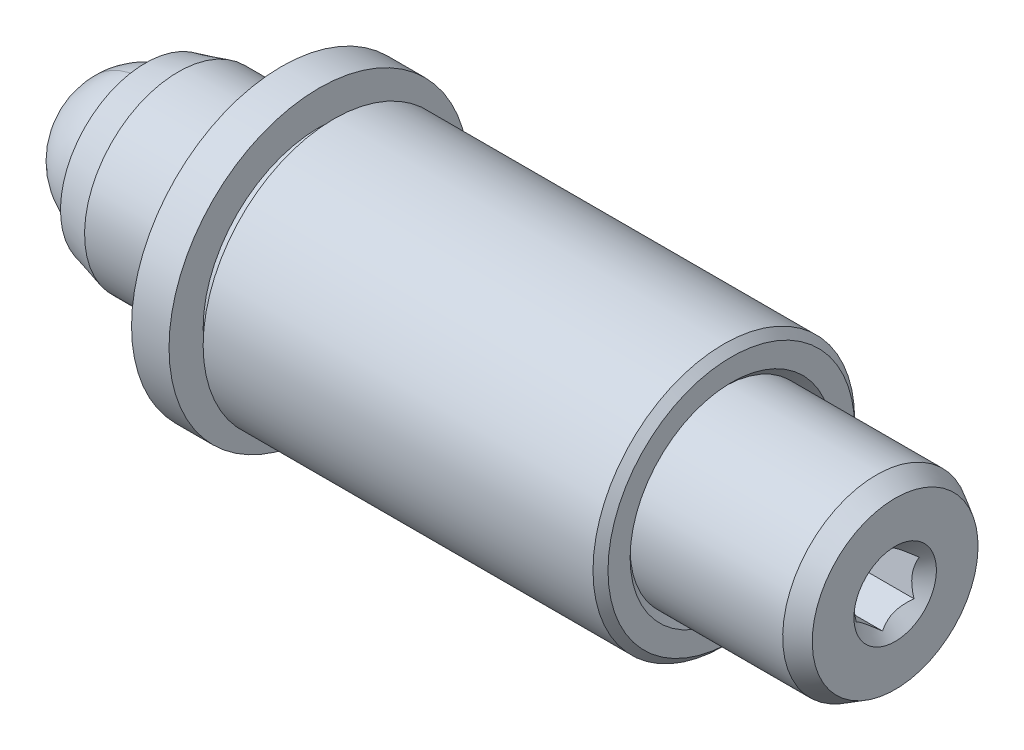
ISO-10303-21;
HEADER;
FILE_DESCRIPTION(('STEP AP214'),'2;1');
FILE_NAME('part.step','',(''),(''),'','','');
FILE_SCHEMA(('AUTOMOTIVE_DESIGN { 1 0 10303 214 1 1 1 1 }'));
ENDSEC;
DATA;
#1=APPLICATION_CONTEXT('core data for automotive mechanical design processes');
#2=APPLICATION_PROTOCOL_DEFINITION('international standard','automotive_design',2000,#1);
#3=PRODUCT_CONTEXT('',#1,'mechanical');
#4=PRODUCT('Part','Part','',(#3));
#5=PRODUCT_RELATED_PRODUCT_CATEGORY('part','',(#4));
#6=PRODUCT_DEFINITION_FORMATION('','',#4);
#7=PRODUCT_DEFINITION_CONTEXT('part definition',#1,'design');
#8=PRODUCT_DEFINITION('design','',#6,#7);
#9=PRODUCT_DEFINITION_SHAPE('','',#8);
#10=(LENGTH_UNIT() NAMED_UNIT(*) SI_UNIT(.MILLI.,.METRE.));
#11=(NAMED_UNIT(*) PLANE_ANGLE_UNIT() SI_UNIT($,.RADIAN.));
#12=(NAMED_UNIT(*) SI_UNIT($,.STERADIAN.) SOLID_ANGLE_UNIT());
#13=UNCERTAINTY_MEASURE_WITH_UNIT(LENGTH_MEASURE(1.E-05),#10,'distance_accuracy_value','');
#14=(GEOMETRIC_REPRESENTATION_CONTEXT(3) GLOBAL_UNCERTAINTY_ASSIGNED_CONTEXT((#13)) GLOBAL_UNIT_ASSIGNED_CONTEXT((#10,
#11,#12)) REPRESENTATION_CONTEXT('',''));
#15=CARTESIAN_POINT('',(0.,0.,0.));
#16=DIRECTION('',(0.,0.,1.));
#17=DIRECTION('',(1.,0.,0.));
#18=AXIS2_PLACEMENT_3D('',#15,#16,#17);
#19=CARTESIAN_POINT('',(25.3187790340393,3.84761011098279,-7.38312383629523));
#20=DIRECTION('',(1.,0.,0.));
#21=DIRECTION('',(0.,-0.151537101196792,-0.988451570366942));
#22=AXIS2_PLACEMENT_3D('',#19,#20,#21);
#23=PLANE('',#22);
#24=CARTESIAN_POINT('',(25.3187790340393,0.709276375067749,-6.90199353999541));
#25=DIRECTION('',(1.,0.,0.));
#26=DIRECTION('',(0.,-0.151537101196792,-0.988451570366942));
#27=AXIS2_PLACEMENT_3D('',#24,#25,#26);
#28=CIRCLE('',#27,2.80838257906458);
#29=CARTESIAN_POINT('',(25.3187790340393,0.283702219984732,-9.67794371046296));
#30=VERTEX_POINT('',#29);
#31=EDGE_CURVE('P0_E29',#30,#30,#28,.T.);
#32=ORIENTED_EDGE('',*,*,#31,.T.);
#33=EDGE_LOOP('',(#32));
#34=FACE_BOUND('',#33,.T.);
#35=CARTESIAN_POINT('',(25.3187790340393,0.709276375067749,-6.90199353999541));
#36=DIRECTION('',(-1.,0.,0.));
#37=DIRECTION('',(0.,0.151537101196792,0.988451570366942));
#38=AXIS2_PLACEMENT_3D('',#35,#36,#37);
#39=CIRCLE('',#38,1.397);
#40=CARTESIAN_POINT('',(25.3187790340393,0.920973705439667,-5.52112669619279));
#41=VERTEX_POINT('',#40);
#42=EDGE_CURVE('P0_E185',#41,#41,#39,.T.);
#43=ORIENTED_EDGE('',*,*,#42,.T.);
#44=EDGE_LOOP('',(#43));
#45=FACE_BOUND('',#44,.T.);
#46=ADVANCED_FACE('P0_F16',(#34,#45),#23,.T.);
#47=CARTESIAN_POINT('',(-0.0812209659606915,0.709276375067749,-6.90199353999541));
#48=DIRECTION('',(-1.,0.,0.));
#49=DIRECTION('',(0.,0.151537101196792,0.988451570366942));
#50=AXIS2_PLACEMENT_3D('',#47,#48,#49);
#51=CYLINDRICAL_SURFACE('',#50,3.175);
#52=CARTESIAN_POINT('',(24.6837790340393,0.709276375067749,-6.90199353999541));
#53=DIRECTION('',(1.,0.,0.));
#54=DIRECTION('',(0.,-0.151537101196792,-0.988451570366942));
#55=AXIS2_PLACEMENT_3D('',#52,#53,#54);
#56=CIRCLE('',#55,3.175);
#57=CARTESIAN_POINT('',(24.6837790340393,0.228146078767935,-10.0403272759104));
#58=VERTEX_POINT('',#57);
#59=EDGE_CURVE('P0_E211',#58,#58,#56,.F.);
#60=ORIENTED_EDGE('',*,*,#59,.T.);
#61=EDGE_LOOP('',(#60));
#62=FACE_BOUND('',#61,.T.);
#63=CARTESIAN_POINT('',(1.03230858147812,0.709276375067749,-6.90199353999541));
#64=DIRECTION('',(-1.,0.,0.));
#65=DIRECTION('',(0.,0.151537101196792,0.988451570366942));
#66=AXIS2_PLACEMENT_3D('',#63,#64,#65);
#67=CIRCLE('',#66,3.175);
#68=CARTESIAN_POINT('',(1.03230858147812,1.19040667136756,-3.76365980408037));
#69=VERTEX_POINT('',#68);
#70=EDGE_CURVE('P0_E208',#69,#69,#67,.T.);
#71=ORIENTED_EDGE('',*,*,#70,.F.);
#72=EDGE_LOOP('',(#71));
#73=FACE_BOUND('',#72,.T.);
#74=ADVANCED_FACE('P0_F89',(#62,#73),#51,.T.);
#75=CARTESIAN_POINT('',(-0.0812209659606915,0.709276375067749,-6.90199353999541));
#76=DIRECTION('',(1.,0.,0.));
#77=DIRECTION('',(0.,-0.151537101196792,-0.988451570366942));
#78=AXIS2_PLACEMENT_3D('',#75,#76,#77);
#79=CONICAL_SURFACE('',#78,2.87663065701558,0.261799387799143);
#80=ORIENTED_EDGE('',*,*,#70,.T.);
#81=EDGE_LOOP('',(#80));
#82=FACE_BOUND('',#81,.T.);
#83=CARTESIAN_POINT('',(-0.0812209659606915,0.709276375067749,-6.90199353999541));
#84=DIRECTION('',(-1.,0.,0.));
#85=DIRECTION('',(0.,0.151537101196792,0.988451570366942));
#86=AXIS2_PLACEMENT_3D('',#83,#84,#85);
#87=CIRCLE('',#86,2.87663065701558);
#88=CARTESIAN_POINT('',(-0.0812209659606915,1.14519264604571,-4.05858344970267));
#89=VERTEX_POINT('',#88);
#90=EDGE_CURVE('P0_E204',#89,#89,#87,.T.);
#91=ORIENTED_EDGE('',*,*,#90,.F.);
#92=EDGE_LOOP('',(#91));
#93=FACE_BOUND('',#92,.T.);
#94=ADVANCED_FACE('P0_F95',(#82,#93),#79,.T.);
#95=CARTESIAN_POINT('',(-0.0812209659606916,3.55268646536049,-7.33790981097337));
#96=DIRECTION('',(-1.,0.,0.));
#97=DIRECTION('',(0.,0.151537101196792,0.988451570366942));
#98=AXIS2_PLACEMENT_3D('',#95,#96,#97);
#99=PLANE('',#98);
#100=ORIENTED_EDGE('',*,*,#90,.T.);
#101=EDGE_LOOP('',(#100));
#102=FACE_BOUND('',#101,.T.);
#103=CARTESIAN_POINT('',(-0.0812209659606915,0.709276375067749,-6.90199353999541));
#104=DIRECTION('',(-1.,0.,0.));
#105=DIRECTION('',(0.,0.151537101196792,0.988451570366942));
#106=AXIS2_PLACEMENT_3D('',#103,#104,#105);
#107=CIRCLE('',#106,2.74963065701558);
#108=CARTESIAN_POINT('',(-0.0812209659606915,1.12594743419372,-4.18411679913927));
#109=VERTEX_POINT('',#108);
#110=EDGE_CURVE('P0_E201',#109,#109,#107,.T.);
#111=ORIENTED_EDGE('',*,*,#110,.F.);
#112=EDGE_LOOP('',(#111));
#113=FACE_BOUND('',#112,.T.);
#114=ADVANCED_FACE('P0_F103',(#102,#113),#99,.T.);
#115=CARTESIAN_POINT('',(1.1094040340393,0.709276375067749,-6.90199353999541));
#116=DIRECTION('',(-1.,0.,0.));
#117=DIRECTION('',(0.,0.151537101196792,0.988451570366942));
#118=AXIS2_PLACEMENT_3D('',#115,#116,#117);
#119=CONICAL_SURFACE('',#118,2.0622229927617,0.523598775598294);
#120=ORIENTED_EDGE('',*,*,#110,.T.);
#121=EDGE_LOOP('',(#120));
#122=FACE_BOUND('',#121,.T.);
#123=CARTESIAN_POINT('',(4.68127903403936,0.709276375067749,-6.90199353999541));
#124=VERTEX_POINT('',#123);
#125=VERTEX_LOOP('',#124);
#126=FACE_BOUND('',#125,.T.);
#127=ADVANCED_FACE('P0_F107',(#122,#126),#119,.F.);
#128=CARTESIAN_POINT('',(24.6837790340393,0.709276375067749,-6.90199353999541));
#129=DIRECTION('',(-1.,0.,0.));
#130=DIRECTION('',(0.,0.151537101196792,0.988451570366942));
#131=AXIS2_PLACEMENT_3D('',#128,#129,#130);
#132=CONICAL_SURFACE('',#131,3.175,0.5235987755983);
#133=ORIENTED_EDGE('',*,*,#31,.F.);
#134=EDGE_LOOP('',(#133));
#135=FACE_BOUND('',#134,.T.);
#136=ORIENTED_EDGE('',*,*,#59,.F.);
#137=EDGE_LOOP('',(#136));
#138=FACE_BOUND('',#137,.T.);
#139=ADVANCED_FACE('P0_F18',(#135,#138),#132,.T.);
#140=CARTESIAN_POINT('',(25.3187790340393,0.709276375067749,-6.90199353999541));
#141=DIRECTION('',(1.,0.,0.));
#142=DIRECTION('',(0.,-0.151537101196792,-0.988451570366942));
#143=AXIS2_PLACEMENT_3D('',#140,#141,#142);
#144=CONICAL_SURFACE('',#143,1.397,0.785398163397454);
#145=ORIENTED_EDGE('',*,*,#42,.F.);
#146=EDGE_LOOP('',(#145));
#147=FACE_BOUND('',#146,.T.);
#148=CARTESIAN_POINT('',(25.0657408748947,1.84005754324019,-7.07514850827498));
#149=CARTESIAN_POINT('',(25.0460896704963,1.81545908651196,-7.10583482017609));
#150=CARTESIAN_POINT('',(25.0275921667767,1.79044930617444,-7.13703425388424));
#151=CARTESIAN_POINT('',(24.9937230506719,1.7394512863709,-7.2006537386072));
#152=CARTESIAN_POINT('',(24.9783702936805,1.7134581919804,-7.23307984608842));
#153=CARTESIAN_POINT('',(24.9520705638843,1.6610441958544,-7.29846574614206));
#154=CARTESIAN_POINT('',(24.9410574527661,1.63463665722172,-7.3314088683865));
#155=CARTESIAN_POINT('',(24.9240884332977,1.58124035587483,-7.39802018370596));
#156=CARTESIAN_POINT('',(24.9181198517434,1.55425322539957,-7.43168634058031));
#157=CARTESIAN_POINT('',(24.9127367487892,1.50774430142119,-7.48970572623337));
#158=CARTESIAN_POINT('',(24.9119406739463,1.48828301913849,-7.51398346791125));
#159=CARTESIAN_POINT('',(24.9132777242888,1.44939814073531,-7.56249193818236));
#160=CARTESIAN_POINT('',(24.915411495714,1.42997455387578,-7.58672265522266));
#161=CARTESIAN_POINT('',(24.9260666004169,1.37198116150141,-7.65906879247284));
#162=CARTESIAN_POINT('',(24.9388429323801,1.33369996508028,-7.70682417592249));
#163=CARTESIAN_POINT('',(24.9696766239764,1.26651217396672,-7.79064022734537));
#164=CARTESIAN_POINT('',(24.9861178455829,1.23729051465984,-7.82709393505824));
#165=CARTESIAN_POINT('',(25.0231539361576,1.17999176444748,-7.8985735136345));
#166=CARTESIAN_POINT('',(25.0437352904535,1.15191129787264,-7.93360359560932));
#167=CARTESIAN_POINT('',(25.0657408748947,1.124337640744,-7.96800143821595));
#168=B_SPLINE_CURVE_WITH_KNOTS('',3,(#148,#149,#150,#151,#152,#153,#154,#155,#156,#157,#158,
#159,#160,#161,#162,#163,#164,#165,#166,#167),.UNSPECIFIED.,.F.,.F.,(4,2,2,2,2,2,2,2,2,4),(0.,
0.13198575731363,0.264741099720079,0.395386727542093,0.525703154748065,0.618943658290853,
0.712204731307293,0.898780059957001,1.04716773824742,1.19507867219892),.UNSPECIFIED.);
#169=CARTESIAN_POINT('',(25.0656253873578,1.83991309926391,-7.07532870059182));
#170=VERTEX_POINT('',#169);
#171=CARTESIAN_POINT('',(25.0656253873578,1.12448208472029,-7.96782124589911));
#172=VERTEX_POINT('',#171);
#173=EDGE_CURVE('P0_E121',#170,#172,#168,.T.);
#174=ORIENTED_EDGE('',*,*,#173,.T.);
#175=CARTESIAN_POINT('',(27.6246008361541,-2.96748976697398,-7.34049101427792));
#176=CARTESIAN_POINT('',(27.5367450230196,-2.87735515648311,-7.35430933173602));
#177=CARTESIAN_POINT('',(27.4490058909628,-2.78710889925952,-7.36814476548261));
#178=CARTESIAN_POINT('',(27.2738397088148,-2.6063100178771,-7.39586260134395));
#179=CARTESIAN_POINT('',(27.1864126789646,-2.51575737456407,-7.40974500639518));
#180=CARTESIAN_POINT('',(27.0116956545964,-2.33399845022917,-7.43761002410175));
#181=CARTESIAN_POINT('',(26.9244068832256,-2.24279101921719,-7.45159281305926));
#182=CARTESIAN_POINT('',(26.7503690541866,-2.05988270148838,-7.47963404146574));
#183=CARTESIAN_POINT('',(26.6636199698372,-1.96818183959071,-7.49369247710975));
#184=CARTESIAN_POINT('',(26.4803043459046,-1.77288881233363,-7.52363237514997));
#185=CARTESIAN_POINT('',(26.3838312071016,-1.66921074381141,-7.53952700715072));
#186=CARTESIAN_POINT('',(26.1922022242586,-1.46063871995851,-7.57150267579545));
#187=CARTESIAN_POINT('',(26.0970466009912,-1.35574456613512,-7.58758374286987));
#188=CARTESIAN_POINT('',(25.9089422514998,-1.1443461696576,-7.61999271581324));
#189=CARTESIAN_POINT('',(25.8159899807509,-1.03784503836504,-7.63632014468693));
#190=CARTESIAN_POINT('',(25.6791646449912,-0.875964153114442,-7.66113770866827));
#191=CARTESIAN_POINT('',(25.6339961203745,-0.821656662135799,-7.66946345775188));
#192=CARTESIAN_POINT('',(25.5448365389851,-0.712107745595139,-7.68625813515389));
#193=CARTESIAN_POINT('',(25.5008454018662,-0.656866384183415,-7.69472705363757));
#194=CARTESIAN_POINT('',(25.4090763841468,-0.538174670739413,-7.71292339094998));
#195=CARTESIAN_POINT('',(25.3615126407606,-0.47456143330758,-7.72267578134235));
#196=CARTESIAN_POINT('',(25.2693699184927,-0.345087429615771,-7.74252512529403));
#197=CARTESIAN_POINT('',(25.2247952840241,-0.279223593418003,-7.75262254949804));
#198=CARTESIAN_POINT('',(25.1411953660683,-0.145672601825798,-7.77309692652829));
#199=CARTESIAN_POINT('',(25.102087431109,-0.0780366904100693,-7.78346602326506));
#200=CARTESIAN_POINT('',(25.031549772854,0.0610169759798711,-7.80478400195742));
#201=CARTESIAN_POINT('',(25.0000974812802,0.132422841030938,-7.81573106109788));
#202=CARTESIAN_POINT('',(24.964565909691,0.235942934991404,-7.83160147440358));
#203=CARTESIAN_POINT('',(24.9553001973986,0.266313306514104,-7.83625748204299));
#204=CARTESIAN_POINT('',(24.9392392324358,0.327695682909499,-7.84566786456692));
#205=CARTESIAN_POINT('',(24.9324438944314,0.358707665579889,-7.85042223604765));
#206=CARTESIAN_POINT('',(24.9217070774874,0.421040229139728,-7.85997828944996));
#207=CARTESIAN_POINT('',(24.9177499167903,0.452358129796872,-7.86477956047166));
#208=CARTESIAN_POINT('',(24.912868461278,0.515233739013183,-7.87441886688005));
#209=CARTESIAN_POINT('',(24.9119446638363,0.546791486049223,-7.87925690816554));
#210=CARTESIAN_POINT('',(24.9131769761599,0.609063059632471,-7.88880361134318));
#211=CARTESIAN_POINT('',(24.9152571918777,0.639778386965046,-7.89351250331708));
#212=CARTESIAN_POINT('',(24.9222306767221,0.700901479384611,-7.9028831356466));
#213=CARTESIAN_POINT('',(24.9271252544042,0.731309094701894,-7.90754485304139));
#214=CARTESIAN_POINT('',(24.9457083321476,0.822054074911334,-7.92145674479345));
#215=CARTESIAN_POINT('',(24.963286410024,0.881621165361508,-7.93058883025334));
#216=CARTESIAN_POINT('',(25.0090126394503,1.00646806456855,-7.94972880409365));
#217=CARTESIAN_POINT('',(25.0383326901798,1.07130493658119,-7.95966878692135));
#218=CARTESIAN_POINT('',(25.1032299269344,1.19790933932228,-7.97907819934508));
#219=CARTESIAN_POINT('',(25.1388203113528,1.25967003616737,-7.98854658125511));
#220=CARTESIAN_POINT('',(25.2144706570072,1.38151649842112,-8.00722656541879));
#221=CARTESIAN_POINT('',(25.2545825996289,1.44157015235773,-8.01643324474093));
#222=CARTESIAN_POINT('',(25.3374567577588,1.55975000354966,-8.03455110969898));
#223=CARTESIAN_POINT('',(25.3802162250975,1.61787810641759,-8.04346258747972));
#224=CARTESIAN_POINT('',(25.4686852652452,1.73420479128877,-8.06129634802569));
#225=CARTESIAN_POINT('',(25.5144420858569,1.79236802191114,-8.07021321115687));
#226=CARTESIAN_POINT('',(25.607335768457,1.90761091340444,-8.08788081798151));
#227=CARTESIAN_POINT('',(25.6544727639041,1.96469046860167,-8.09663154547439));
#228=CARTESIAN_POINT('',(25.7974048793696,2.13474514674196,-8.12270221372247));
#229=CARTESIAN_POINT('',(25.8946884834053,2.24649458738522,-8.13983424811153));
#230=CARTESIAN_POINT('',(26.0917102888441,2.46821789374279,-8.17382610782472));
#231=CARTESIAN_POINT('',(26.1914528502648,2.57818793223579,-8.19068534640688));
#232=CARTESIAN_POINT('',(26.3923720087802,2.79679528824881,-8.22419950736695));
#233=CARTESIAN_POINT('',(26.4935482921097,2.90543288794888,-8.24085447300519));
#234=CARTESIAN_POINT('',(26.6864803553642,3.11074780750801,-8.27233080292886));
#235=CARTESIAN_POINT('',(26.7781415556776,3.20751223332088,-8.28716552121577));
#236=CARTESIAN_POINT('',(26.9620452353932,3.40051157416295,-8.31675377978189));
#237=CARTESIAN_POINT('',(27.0542877526351,3.49674645394248,-8.33150731465705));
#238=CARTESIAN_POINT('',(27.2388792475286,3.68847593743714,-8.36090089448813));
#239=CARTESIAN_POINT('',(27.3312267260393,3.78397195293414,-8.37554115588089));
#240=CARTESIAN_POINT('',(27.5162486679006,3.97463928273758,-8.40477189951826));
#241=CARTESIAN_POINT('',(27.6089231042404,4.06981062264518,-8.41936238568771));
#242=CARTESIAN_POINT('',(27.7017186616355,4.16486586555687,-8.43393507330967));
#243=B_SPLINE_CURVE_WITH_KNOTS('',3,(#175,#176,#177,#178,#179,#180,#181,#182,#183,#184,#185,
#186,#187,#188,#189,#190,#191,#192,#193,#194,#195,#196,#197,#198,#199,#200,#201,#202,#203,#204,
#205,#206,#207,#208,#209,#210,#211,#212,#213,#214,#215,#216,#217,#218,#219,#220,#221,#222,#223,
#224,#225,#226,#227,#228,#229,#230,#231,#232,#233,#234,#235,#236,#237,#238,#239,#240,#241,#242),
.UNSPECIFIED.,.F.,.F.,(4,2,2,2,2,2,2,2,2,2,2,2,2,2,2,2,2,2,2,2,2,2,2,2,2,2,2,2,2,2,2,2,2,4),(0.,
0.379874835988938,0.759773876203374,1.14082701041048,1.52186115387162,1.94938001736954,
2.37696967257862,2.80381700436518,3.01718157744285,3.23053155296424,3.47055378498738,
3.71091762864544,3.94712387105913,4.18262512424182,4.27881732966127,4.37500621199584,
4.47065944041732,4.56632835209358,4.65962213579648,4.75295933214987,4.94050930933201,
5.15555780798493,5.37106449029749,5.58936617401833,5.80744493764421,6.03103556745281,
6.25464788967338,6.70203244465328,7.15027722868556,7.5984253860746,8.00074953073231,
8.40310014008475,8.80404436426246,9.20495620671305),.UNSPECIFIED.);
#244=CARTESIAN_POINT('',(25.0656253873578,-0.00615463947587164,-7.7944860853027));
#245=VERTEX_POINT('',#244);
#246=EDGE_CURVE('P0_E128',#172,#245,#243,.F.);
#247=ORIENTED_EDGE('',*,*,#246,.T.);
#248=CARTESIAN_POINT('',(25.0657408748947,-0.00607081034006399,-7.794701273614));
#249=CARTESIAN_POINT('',(25.0460896704963,-0.0203467076307624,-7.7580552292429));
#250=CARTESIAN_POINT('',(25.0275921667767,-0.034861319636949,-7.72079640727347));
#251=CARTESIAN_POINT('',(24.9937230506719,-0.0644583996809437,-7.64482108421942));
#252=CARTESIAN_POINT('',(24.9783702936805,-0.0795436853102713,-7.60609735041368));
#253=CARTESIAN_POINT('',(24.9520705638843,-0.109962537743033,-7.52801254822788));
#254=CARTESIAN_POINT('',(24.9410574527661,-0.125288349170359,-7.48867138779834));
#255=CARTESIAN_POINT('',(24.9240884332977,-0.156277289743058,-7.40912317670407));
#256=CARTESIAN_POINT('',(24.9181198517434,-0.171939471606412,-7.36891855770007));
#257=CARTESIAN_POINT('',(24.9127367487892,-0.198931271504737,-7.29963095520559));
#258=CARTESIAN_POINT('',(24.9119406739463,-0.210225771402947,-7.27063811951961));
#259=CARTESIAN_POINT('',(24.9132777242888,-0.232792899754859,-7.21270859186383));
#260=CARTESIAN_POINT('',(24.915411495714,-0.244065522833903,-7.18377191369072));
#261=CARTESIAN_POINT('',(24.9260666004169,-0.277722419371048,-7.09737509401778));
#262=CARTESIAN_POINT('',(24.9388429323801,-0.299939196395348,-7.040344913705));
#263=CARTESIAN_POINT('',(24.9696766239764,-0.338932130615687,-6.94025055406505));
#264=CARTESIAN_POINT('',(24.9861178455829,-0.355891137903729,-6.89671700090813));
#265=CARTESIAN_POINT('',(25.0231539361576,-0.389144893696389,-6.811355038331));
#266=CARTESIAN_POINT('',(25.0437352904535,-0.405441601295819,-6.76952159993965));
#267=CARTESIAN_POINT('',(25.0657408748947,-0.421444178264215,-6.7284431910877));
#268=B_SPLINE_CURVE_WITH_KNOTS('',3,(#248,#249,#250,#251,#252,#253,#254,#255,#256,#257,#258,
#259,#260,#261,#262,#263,#264,#265,#266,#267),.UNSPECIFIED.,.F.,.F.,(4,2,2,2,2,2,2,2,2,4),(0.,
0.13198575731363,0.264741099720076,0.395386727542088,0.525703154748062,0.618943658290851,
0.712204731307289,0.898780059956998,1.04716773824742,1.19507867219892),.UNSPECIFIED.);
#269=CARTESIAN_POINT('',(25.0656253873578,-0.421360349128405,-6.728658379399));
#270=VERTEX_POINT('',#269);
#271=EDGE_CURVE('P0_E157',#245,#270,#268,.T.);
#272=ORIENTED_EDGE('',*,*,#271,.T.);
#273=CARTESIAN_POINT('',(25.0657408748947,-0.42150479310469,-6.72883857171585));
#274=CARTESIAN_POINT('',(25.0460896704963,-0.396906336376455,-6.69815225981473));
#275=CARTESIAN_POINT('',(25.0275921667767,-0.371896556038938,-6.66695282610658));
#276=CARTESIAN_POINT('',(24.9937230506719,-0.320898536235396,-6.60333334138362));
#277=CARTESIAN_POINT('',(24.9783702936805,-0.294905441844903,-6.57090723390241));
#278=CARTESIAN_POINT('',(24.9520705638843,-0.242491445718898,-6.50552133384876));
#279=CARTESIAN_POINT('',(24.9410574527661,-0.216083907086223,-6.47257821160432));
#280=CARTESIAN_POINT('',(24.9240884332977,-0.16268760573933,-6.40596689628486));
#281=CARTESIAN_POINT('',(24.9181198517434,-0.135700475264071,-6.37230073941051));
#282=CARTESIAN_POINT('',(24.9127367487892,-0.0891915512856962,-6.31428135375745));
#283=CARTESIAN_POINT('',(24.9119406739463,-0.0697302690029892,-6.29000361207957));
#284=CARTESIAN_POINT('',(24.9132777242888,-0.0308453905998091,-6.24149514180846));
#285=CARTESIAN_POINT('',(24.915411495714,-0.0114218037402811,-6.21726442476817));
#286=CARTESIAN_POINT('',(24.9260666004169,0.0465715886340904,-6.14491828751799));
#287=CARTESIAN_POINT('',(24.9388429323801,0.0848527850552218,-6.09716290406833));
#288=CARTESIAN_POINT('',(24.9696766239764,0.152040576168778,-6.01334685264545));
#289=CARTESIAN_POINT('',(24.9861178455829,0.181262235475657,-5.97689314493258));
#290=CARTESIAN_POINT('',(25.0231539361576,0.238560985688022,-5.90541356635633));
#291=CARTESIAN_POINT('',(25.0437352904535,0.266641452262862,-5.8703834843815));
#292=CARTESIAN_POINT('',(25.0657408748947,0.294215109391498,-5.83598564177488));
#293=B_SPLINE_CURVE_WITH_KNOTS('',3,(#273,#274,#275,#276,#277,#278,#279,#280,#281,#282,#283,
#284,#285,#286,#287,#288,#289,#290,#291,#292),.UNSPECIFIED.,.F.,.F.,(4,2,2,2,2,2,2,2,2,4),(0.,
0.131985757313632,0.264741099720078,0.395386727542091,0.525703154748064,0.618943658290851,
0.71220473130729,0.898780059957001,1.04716773824742,1.19507867219892),.UNSPECIFIED.);
#294=CARTESIAN_POINT('',(25.0656253873578,0.294070665415212,-5.83616583409172));
#295=VERTEX_POINT('',#294);
#296=EDGE_CURVE('P0_E152',#270,#295,#293,.T.);
#297=ORIENTED_EDGE('',*,*,#296,.T.);
#298=CARTESIAN_POINT('',(27.6246008361541,-2.6672644620829,-5.38217076306693));
#299=CARTESIAN_POINT('',(27.5367450230196,-2.57712985159202,-5.39598908052503));
#300=CARTESIAN_POINT('',(27.4490058909628,-2.48688359436843,-5.40982451427162));
#301=CARTESIAN_POINT('',(27.2738397088149,-2.30608471298601,-5.43754235013296));
#302=CARTESIAN_POINT('',(27.1864126789646,-2.21553206967298,-5.45142475518419));
#303=CARTESIAN_POINT('',(27.0116956545964,-2.03377314533808,-5.47928977289076));
#304=CARTESIAN_POINT('',(26.9244068832256,-1.9425657143261,-5.49327256184827));
#305=CARTESIAN_POINT('',(26.7503690541866,-1.7596573965973,-5.52131379025475));
#306=CARTESIAN_POINT('',(26.6636199698372,-1.66795653469963,-5.53537222589876));
#307=CARTESIAN_POINT('',(26.4803043459046,-1.47266350744255,-5.56531212393898));
#308=CARTESIAN_POINT('',(26.3838312071016,-1.36898543892033,-5.58120675593972));
#309=CARTESIAN_POINT('',(26.1922022242586,-1.16041341506742,-5.61318242458445));
#310=CARTESIAN_POINT('',(26.0970466009912,-1.05551926124403,-5.62926349165887));
#311=CARTESIAN_POINT('',(25.9089422514998,-0.844120864766512,-5.66167246460224));
#312=CARTESIAN_POINT('',(25.8159899807509,-0.73761973347395,-5.67799989347593));
#313=CARTESIAN_POINT('',(25.6791646449912,-0.575738848223351,-5.70281745745728));
#314=CARTESIAN_POINT('',(25.6339961203745,-0.521431357244707,-5.71114320654089));
#315=CARTESIAN_POINT('',(25.5448365389851,-0.41188244070405,-5.7279378839429));
#316=CARTESIAN_POINT('',(25.5008454018662,-0.35664107929233,-5.73640680242658));
#317=CARTESIAN_POINT('',(25.4090763841468,-0.237949365848329,-5.754603139739));
#318=CARTESIAN_POINT('',(25.3615126407606,-0.174336128416492,-5.76435553013135));
#319=CARTESIAN_POINT('',(25.2693699184927,-0.0448621247246804,-5.78420487408304));
#320=CARTESIAN_POINT('',(25.2247952840241,0.0210017114730864,-5.79430229828705));
#321=CARTESIAN_POINT('',(25.1411953660684,0.154552703065293,-5.8147766753173));
#322=CARTESIAN_POINT('',(25.102087431109,0.222188614481025,-5.82514577205406));
#323=CARTESIAN_POINT('',(25.031549772854,0.361242280870962,-5.84646375074643));
#324=CARTESIAN_POINT('',(25.0000974812801,0.432648145922021,-5.85741080988691));
#325=CARTESIAN_POINT('',(24.964565909691,0.536168239882489,-5.87328122319259));
#326=CARTESIAN_POINT('',(24.9553001973986,0.566538611405191,-5.877937230832));
#327=CARTESIAN_POINT('',(24.9392392324358,0.627920987800587,-5.88734761335593));
#328=CARTESIAN_POINT('',(24.9324438944314,0.658932970470977,-5.89210198483666));
#329=CARTESIAN_POINT('',(24.9217070774874,0.721265534030815,-5.90165803823897));
#330=CARTESIAN_POINT('',(24.9177499167903,0.752583434687958,-5.90645930926066));
#331=CARTESIAN_POINT('',(24.912868461278,0.815459043904269,-5.91609861566906));
#332=CARTESIAN_POINT('',(24.9119446638363,0.847016790940307,-5.92093665695455));
#333=CARTESIAN_POINT('',(24.9131769761599,0.909288364523554,-5.9304833601322));
#334=CARTESIAN_POINT('',(24.9152571918777,0.940003691856129,-5.93519225210609));
#335=CARTESIAN_POINT('',(24.9222306767221,1.00112678427569,-5.9445628844356));
#336=CARTESIAN_POINT('',(24.9271252544042,1.03153439959298,-5.94922460183039));
#337=CARTESIAN_POINT('',(24.9457083321476,1.12227937980242,-5.96313649358246));
#338=CARTESIAN_POINT('',(24.963286410024,1.18184647025259,-5.97226857904235));
#339=CARTESIAN_POINT('',(25.0090126394503,1.30669336945964,-5.99140855288267));
#340=CARTESIAN_POINT('',(25.0383326901798,1.37153024147228,-6.00134853571036));
#341=CARTESIAN_POINT('',(25.1032299269344,1.49813464421336,-6.02075794813409));
#342=CARTESIAN_POINT('',(25.1388203113528,1.55989534105846,-6.03022633004412));
#343=CARTESIAN_POINT('',(25.2144706570072,1.68174180331221,-6.04890631420779));
#344=CARTESIAN_POINT('',(25.2545825996289,1.74179545724881,-6.05811299352993));
#345=CARTESIAN_POINT('',(25.3374567577588,1.85997530844074,-6.07623085848799));
#346=CARTESIAN_POINT('',(25.3802162250975,1.91810341130867,-6.08514233626875));
#347=CARTESIAN_POINT('',(25.4686852652452,2.03443009617985,-6.10297609681472));
#348=CARTESIAN_POINT('',(25.5144420858569,2.09259332680222,-6.11189295994589));
#349=CARTESIAN_POINT('',(25.607335768457,2.20783621829552,-6.12956056677051));
#350=CARTESIAN_POINT('',(25.6544727639041,2.26491577349275,-6.13831129426339));
#351=CARTESIAN_POINT('',(25.7974048793696,2.43497045163304,-6.16438196251148));
#352=CARTESIAN_POINT('',(25.8946884834053,2.5467198922763,-6.18151399690053));
#353=CARTESIAN_POINT('',(26.0917102888441,2.76844319863387,-6.21550585661372));
#354=CARTESIAN_POINT('',(26.1914528502648,2.87841323712687,-6.23236509519588));
#355=CARTESIAN_POINT('',(26.3923720087802,3.0970205931399,-6.26587925615595));
#356=CARTESIAN_POINT('',(26.4935482921097,3.20565819283997,-6.28253422179419));
#357=CARTESIAN_POINT('',(26.6864803553642,3.4109731123991,-6.31401055171787));
#358=CARTESIAN_POINT('',(26.7781415556776,3.50773753821196,-6.32884527000478));
#359=CARTESIAN_POINT('',(26.9620452353932,3.70073687905403,-6.3584335285709));
#360=CARTESIAN_POINT('',(27.0542877526351,3.79697175883357,-6.37318706344605));
#361=CARTESIAN_POINT('',(27.2388792475286,3.98870124232822,-6.40258064327713));
#362=CARTESIAN_POINT('',(27.3312267260393,4.08419725782522,-6.4172209046699));
#363=CARTESIAN_POINT('',(27.5162486679006,4.27486458762867,-6.44645164830726));
#364=CARTESIAN_POINT('',(27.6089231042404,4.37003592753627,-6.46104213447672));
#365=CARTESIAN_POINT('',(27.7017186616355,4.46509117044797,-6.47561482209869));
#366=B_SPLINE_CURVE_WITH_KNOTS('',3,(#298,#299,#300,#301,#302,#303,#304,#305,#306,#307,#308,
#309,#310,#311,#312,#313,#314,#315,#316,#317,#318,#319,#320,#321,#322,#323,#324,#325,#326,#327,
#328,#329,#330,#331,#332,#333,#334,#335,#336,#337,#338,#339,#340,#341,#342,#343,#344,#345,#346,
#347,#348,#349,#350,#351,#352,#353,#354,#355,#356,#357,#358,#359,#360,#361,#362,#363,#364,#365),
.UNSPECIFIED.,.F.,.F.,(4,2,2,2,2,2,2,2,2,2,2,2,2,2,2,2,2,2,2,2,2,2,2,2,2,2,2,2,2,2,2,2,2,4),(0.,
0.379874835988939,0.759773876203367,1.14082701041048,1.52186115387162,1.94938001736954,
2.37696967257862,2.80381700436518,3.01718157744285,3.23053155296424,3.47055378498738,
3.71091762864544,3.94712387105914,4.18262512424182,4.27881732966127,4.37500621199584,
4.47065944041731,4.56632835209357,4.65962213579648,4.75295933214987,4.94050930933201,
5.15555780798492,5.37106449029748,5.58936617401833,5.8074449376442,6.0310355674528,
6.25464788967337,6.70203244465328,7.15027722868555,7.5984253860746,8.00074953073231,
8.40310014008474,8.80404436426245,9.20495620671304),.UNSPECIFIED.);
#367=CARTESIAN_POINT('',(25.0656253873578,1.42470738961137,-6.00950099468811));
#368=VERTEX_POINT('',#367);
#369=EDGE_CURVE('P0_E35',#295,#368,#366,.T.);
#370=ORIENTED_EDGE('',*,*,#369,.T.);
#371=CARTESIAN_POINT('',(25.0657408748947,1.42462356047556,-6.00928580637681));
#372=CARTESIAN_POINT('',(25.0460896704963,1.43889945776626,-6.04593185074792));
#373=CARTESIAN_POINT('',(25.0275921667767,1.45341406977245,-6.08319067271735));
#374=CARTESIAN_POINT('',(24.9937230506719,1.48301114981644,-6.1591659957714));
#375=CARTESIAN_POINT('',(24.9783702936805,1.49809643544577,-6.19788972957714));
#376=CARTESIAN_POINT('',(24.9520705638843,1.52851528787853,-6.27597453176294));
#377=CARTESIAN_POINT('',(24.9410574527661,1.54384109930586,-6.31531569219248));
#378=CARTESIAN_POINT('',(24.9240884332977,1.57483003987856,-6.39486390328675));
#379=CARTESIAN_POINT('',(24.9181198517434,1.59049222174191,-6.43506852229074));
#380=CARTESIAN_POINT('',(24.9127367487892,1.61748402164023,-6.50435612478522));
#381=CARTESIAN_POINT('',(24.9119406739463,1.62877852153844,-6.53334896047121));
#382=CARTESIAN_POINT('',(24.9132777242888,1.65134564989036,-6.59127848812699));
#383=CARTESIAN_POINT('',(24.915411495714,1.6626182729694,-6.6202151663001));
#384=CARTESIAN_POINT('',(24.9260666004169,1.69627516950655,-6.70661198597304));
#385=CARTESIAN_POINT('',(24.9388429323801,1.71849194653085,-6.76364216628583));
#386=CARTESIAN_POINT('',(24.9696766239764,1.75748488075118,-6.86373652592577));
#387=CARTESIAN_POINT('',(24.9861178455829,1.77444388803923,-6.90727007908269));
#388=CARTESIAN_POINT('',(25.0231539361576,1.80769764383189,-6.99263204165982));
#389=CARTESIAN_POINT('',(25.0437352904535,1.82399435143132,-7.03446548005117));
#390=CARTESIAN_POINT('',(25.0657408748947,1.83999692839971,-7.07554388890312));
#391=B_SPLINE_CURVE_WITH_KNOTS('',3,(#371,#372,#373,#374,#375,#376,#377,#378,#379,#380,#381,
#382,#383,#384,#385,#386,#387,#388,#389,#390),.UNSPECIFIED.,.F.,.F.,(4,2,2,2,2,2,2,2,2,4),(0.,
0.131985757313631,0.264741099720077,0.395386727542092,0.525703154748065,0.618943658290854,
0.712204731307296,0.898780059957007,1.04716773824743,1.19507867219892),.UNSPECIFIED.);
#392=EDGE_CURVE('P0_E10',#368,#170,#391,.T.);
#393=ORIENTED_EDGE('',*,*,#392,.T.);
#394=EDGE_LOOP('',(#174,#247,#272,#297,#370,#393));
#395=FACE_BOUND('',#394,.T.);
#396=ADVANCED_FACE('P0_F135',(#147,#395),#144,.F.);
#397=CARTESIAN_POINT('',(22.2707790340393,1.83991309926391,-7.07532870059182));
#398=DIRECTION('',(0.,0.931792720946788,0.362990805931196));
#399=DIRECTION('',(0.,-0.362990805931196,0.931792720946788));
#400=AXIS2_PLACEMENT_3D('',#397,#398,#399);
#401=PLANE('',#400);
#402=ORIENTED_EDGE('',*,*,#392,.F.);
#403=DIRECTION('',(1.,0.,0.));
#404=VECTOR('',#403,1.);
#405=CARTESIAN_POINT('',(22.2707790340393,1.42470738961137,-6.00950099468811));
#406=LINE('',#405,#404);
#407=CARTESIAN_POINT('',(22.2707790340393,1.42470738961137,-6.00950099468811));
#408=VERTEX_POINT('',#407);
#409=EDGE_CURVE('P0_E184',#408,#368,#406,.T.);
#410=ORIENTED_EDGE('',*,*,#409,.F.);
#411=DIRECTION('',(0.,-0.362990805931196,0.931792720946788));
#412=VECTOR('',#411,1.);
#413=CARTESIAN_POINT('',(22.2707790340393,1.83991309926391,-7.07532870059182));
#414=LINE('',#413,#412);
#415=CARTESIAN_POINT('',(22.2707790340393,1.83991309926391,-7.07532870059182));
#416=VERTEX_POINT('',#415);
#417=EDGE_CURVE('P0_E327',#416,#408,#414,.T.);
#418=ORIENTED_EDGE('',*,*,#417,.F.);
#419=DIRECTION('',(1.,0.,0.));
#420=VECTOR('',#419,1.);
#421=CARTESIAN_POINT('',(22.2707790340393,1.83991309926391,-7.07532870059182));
#422=LINE('',#421,#420);
#423=EDGE_CURVE('P0_E194',#416,#170,#422,.T.);
#424=ORIENTED_EDGE('',*,*,#423,.T.);
#425=EDGE_LOOP('',(#402,#410,#418,#424));
#426=FACE_BOUND('',#425,.T.);
#427=ADVANCED_FACE('P0_F117',(#426),#401,.F.);
#428=CARTESIAN_POINT('',(22.2707790340393,1.42470738961137,-6.00950099468811));
#429=DIRECTION('',(0.,0.151537101196792,0.988451570366941));
#430=DIRECTION('',(1.,0.,0.));
#431=AXIS2_PLACEMENT_3D('',#428,#429,#430);
#432=PLANE('',#431);
#433=ORIENTED_EDGE('',*,*,#369,.F.);
#434=DIRECTION('',(1.,0.,0.));
#435=VECTOR('',#434,1.);
#436=CARTESIAN_POINT('',(22.2707790340393,0.294070665415215,-5.83616583409172));
#437=LINE('',#436,#435);
#438=CARTESIAN_POINT('',(22.2707790340393,0.294070665415215,-5.83616583409172));
#439=VERTEX_POINT('',#438);
#440=EDGE_CURVE('P0_E181',#439,#295,#437,.T.);
#441=ORIENTED_EDGE('',*,*,#440,.F.);
#442=DIRECTION('',(0.,-0.988451570366942,0.151537101196792));
#443=VECTOR('',#442,1.);
#444=CARTESIAN_POINT('',(22.2707790340393,1.42470738961137,-6.00950099468811));
#445=LINE('',#444,#443);
#446=EDGE_CURVE('P0_E328',#408,#439,#445,.T.);
#447=ORIENTED_EDGE('',*,*,#446,.F.);
#448=ORIENTED_EDGE('',*,*,#409,.T.);
#449=EDGE_LOOP('',(#433,#441,#447,#448));
#450=FACE_BOUND('',#449,.T.);
#451=ADVANCED_FACE('P0_F168',(#450),#432,.F.);
#452=CARTESIAN_POINT('',(22.2707790340393,0.294070665415215,-5.83616583409172));
#453=DIRECTION('',(0.,-0.780255619749997,0.625460764435746));
#454=DIRECTION('',(0.,-0.625460764435746,-0.780255619749997));
#455=AXIS2_PLACEMENT_3D('',#452,#453,#454);
#456=PLANE('',#455);
#457=ORIENTED_EDGE('',*,*,#296,.F.);
#458=DIRECTION('',(1.,0.,0.));
#459=VECTOR('',#458,1.);
#460=CARTESIAN_POINT('',(22.2707790340393,-0.421360349128409,-6.72865837939901));
#461=LINE('',#460,#459);
#462=CARTESIAN_POINT('',(22.2707790340393,-0.421360349128409,-6.72865837939901));
#463=VERTEX_POINT('',#462);
#464=EDGE_CURVE('P0_E190',#463,#270,#461,.T.);
#465=ORIENTED_EDGE('',*,*,#464,.F.);
#466=DIRECTION('',(0.,-0.625460764435746,-0.780255619749997));
#467=VECTOR('',#466,1.);
#468=CARTESIAN_POINT('',(22.2707790340393,0.294070665415215,-5.83616583409172));
#469=LINE('',#468,#467);
#470=EDGE_CURVE('P0_E189',#439,#463,#469,.T.);
#471=ORIENTED_EDGE('',*,*,#470,.F.);
#472=ORIENTED_EDGE('',*,*,#440,.T.);
#473=EDGE_LOOP('',(#457,#465,#471,#472));
#474=FACE_BOUND('',#473,.T.);
#475=ADVANCED_FACE('P0_F164',(#474),#456,.F.);
#476=CARTESIAN_POINT('',(22.2707790340393,-0.00615463947586947,-7.7944860853027));
#477=DIRECTION('',(0.,-0.931792720946788,-0.362990805931196));
#478=DIRECTION('',(0.,0.362990805931196,-0.931792720946788));
#479=AXIS2_PLACEMENT_3D('',#476,#477,#478);
#480=PLANE('',#479);
#481=ORIENTED_EDGE('',*,*,#271,.F.);
#482=DIRECTION('',(1.,0.,0.));
#483=VECTOR('',#482,1.);
#484=CARTESIAN_POINT('',(22.2707790340393,-0.00615463947586947,-7.7944860853027));
#485=LINE('',#484,#483);
#486=CARTESIAN_POINT('',(22.2707790340393,-0.00615463947586947,-7.7944860853027));
#487=VERTEX_POINT('',#486);
#488=EDGE_CURVE('P0_E192',#487,#245,#485,.T.);
#489=ORIENTED_EDGE('',*,*,#488,.F.);
#490=DIRECTION('',(0.,0.362990805931196,-0.931792720946788));
#491=VECTOR('',#490,1.);
#492=CARTESIAN_POINT('',(22.2707790340393,-0.00615463947586947,-7.7944860853027));
#493=LINE('',#492,#491);
#494=EDGE_CURVE('P0_E305',#463,#487,#493,.T.);
#495=ORIENTED_EDGE('',*,*,#494,.F.);
#496=ORIENTED_EDGE('',*,*,#464,.T.);
#497=EDGE_LOOP('',(#481,#489,#495,#496));
#498=FACE_BOUND('',#497,.T.);
#499=ADVANCED_FACE('P0_F161',(#498),#480,.F.);
#500=CARTESIAN_POINT('',(22.2707790340393,1.12448208472029,-7.9678212458991));
#501=DIRECTION('',(0.,-0.151537101196792,-0.988451570366941));
#502=DIRECTION('',(-1.,0.,0.));
#503=AXIS2_PLACEMENT_3D('',#500,#501,#502);
#504=PLANE('',#503);
#505=ORIENTED_EDGE('',*,*,#246,.F.);
#506=DIRECTION('',(1.,0.,0.));
#507=VECTOR('',#506,1.);
#508=CARTESIAN_POINT('',(22.2707790340393,1.12448208472029,-7.9678212458991));
#509=LINE('',#508,#507);
#510=CARTESIAN_POINT('',(22.2707790340393,1.12448208472029,-7.9678212458991));
#511=VERTEX_POINT('',#510);
#512=EDGE_CURVE('P0_E205',#511,#172,#509,.T.);
#513=ORIENTED_EDGE('',*,*,#512,.F.);
#514=DIRECTION('',(0.,0.988451570366942,-0.151537101196792));
#515=VECTOR('',#514,1.);
#516=CARTESIAN_POINT('',(22.2707790340393,1.12448208472029,-7.9678212458991));
#517=LINE('',#516,#515);
#518=EDGE_CURVE('P0_E200',#487,#511,#517,.T.);
#519=ORIENTED_EDGE('',*,*,#518,.F.);
#520=ORIENTED_EDGE('',*,*,#488,.T.);
#521=EDGE_LOOP('',(#505,#513,#519,#520));
#522=FACE_BOUND('',#521,.T.);
#523=ADVANCED_FACE('P0_F115',(#522),#504,.F.);
#524=CARTESIAN_POINT('',(22.2707790340393,1.83991309926391,-7.07532870059182));
#525=DIRECTION('',(0.,0.780255619749997,-0.625460764435746));
#526=DIRECTION('',(0.,0.625460764435746,0.780255619749997));
#527=AXIS2_PLACEMENT_3D('',#524,#525,#526);
#528=PLANE('',#527);
#529=ORIENTED_EDGE('',*,*,#173,.F.);
#530=ORIENTED_EDGE('',*,*,#423,.F.);
#531=DIRECTION('',(0.,0.625460764435746,0.780255619749997));
#532=VECTOR('',#531,1.);
#533=CARTESIAN_POINT('',(22.2707790340393,1.83991309926391,-7.07532870059182));
#534=LINE('',#533,#532);
#535=EDGE_CURVE('P0_E127',#511,#416,#534,.T.);
#536=ORIENTED_EDGE('',*,*,#535,.F.);
#537=ORIENTED_EDGE('',*,*,#512,.T.);
#538=EDGE_LOOP('',(#529,#530,#536,#537));
#539=FACE_BOUND('',#538,.T.);
#540=ADVANCED_FACE('P0_F112',(#539),#528,.F.);
#541=CARTESIAN_POINT('',(22.2707790340393,0.709276375067749,-6.90199353999541));
#542=DIRECTION('',(-1.,0.,0.));
#543=DIRECTION('',(0.,0.151537101196792,0.988451570366942));
#544=AXIS2_PLACEMENT_3D('',#541,#542,#543);
#545=PLANE('',#544);
#546=ORIENTED_EDGE('',*,*,#535,.T.);
#547=CARTESIAN_POINT('',(22.2707790340393,0.709276375067749,-6.90199353999541));
#548=DIRECTION('',(1.,0.,0.));
#549=DIRECTION('',(0.,-0.151537101196792,-0.988451570366942));
#550=AXIS2_PLACEMENT_3D('',#547,#548,#549);
#551=CIRCLE('',#550,1.14384635331849);
#552=EDGE_CURVE('P0_E338',#511,#416,#551,.T.);
#553=ORIENTED_EDGE('',*,*,#552,.F.);
#554=EDGE_LOOP('',(#546,#553));
#555=FACE_BOUND('',#554,.T.);
#556=ADVANCED_FACE('P0_F86',(#555),#545,.T.);
#557=ORIENTED_EDGE('',*,*,#417,.T.);
#558=EDGE_CURVE('P0_E337',#416,#408,#551,.T.);
#559=ORIENTED_EDGE('',*,*,#558,.F.);
#560=EDGE_LOOP('',(#557,#559));
#561=FACE_BOUND('',#560,.T.);
#562=ADVANCED_FACE('P0_F268',(#561),#545,.T.);
#563=ORIENTED_EDGE('',*,*,#446,.T.);
#564=EDGE_CURVE('P0_E334',#408,#439,#551,.T.);
#565=ORIENTED_EDGE('',*,*,#564,.F.);
#566=EDGE_LOOP('',(#563,#565));
#567=FACE_BOUND('',#566,.T.);
#568=ADVANCED_FACE('P0_F275',(#567),#545,.T.);
#569=ORIENTED_EDGE('',*,*,#470,.T.);
#570=EDGE_CURVE('P0_E332',#439,#463,#551,.T.);
#571=ORIENTED_EDGE('',*,*,#570,.F.);
#572=EDGE_LOOP('',(#569,#571));
#573=FACE_BOUND('',#572,.T.);
#574=ADVANCED_FACE('P0_F282',(#573),#545,.T.);
#575=ORIENTED_EDGE('',*,*,#494,.T.);
#576=EDGE_CURVE('P0_E307',#463,#487,#551,.T.);
#577=ORIENTED_EDGE('',*,*,#576,.F.);
#578=EDGE_LOOP('',(#575,#577));
#579=FACE_BOUND('',#578,.T.);
#580=ADVANCED_FACE('P0_F83',(#579),#545,.T.);
#581=ORIENTED_EDGE('',*,*,#518,.T.);
#582=EDGE_CURVE('P0_E339',#487,#511,#551,.T.);
#583=ORIENTED_EDGE('',*,*,#582,.F.);
#584=EDGE_LOOP('',(#581,#583));
#585=FACE_BOUND('',#584,.T.);
#586=ADVANCED_FACE('P0_F76',(#585),#545,.T.);
#587=CARTESIAN_POINT('',(21.1269326807208,0.709276375067749,-6.90199353999541));
#588=DIRECTION('',(1.,0.,0.));
#589=DIRECTION('',(0.,-0.151537101196792,-0.988451570366942));
#590=AXIS2_PLACEMENT_3D('',#587,#588,#589);
#591=CONICAL_SURFACE('',#590,0.,0.785398163397442);
#592=ORIENTED_EDGE('',*,*,#552,.T.);
#593=ORIENTED_EDGE('',*,*,#558,.T.);
#594=ORIENTED_EDGE('',*,*,#564,.T.);
#595=ORIENTED_EDGE('',*,*,#570,.T.);
#596=ORIENTED_EDGE('',*,*,#576,.T.);
#597=ORIENTED_EDGE('',*,*,#582,.T.);
#598=EDGE_LOOP('',(#592,#593,#594,#595,#596,#597));
#599=FACE_BOUND('',#598,.T.);
#600=CARTESIAN_POINT('',(21.1269326807208,0.709276375067749,-6.90199353999541));
#601=VERTEX_POINT('',#600);
#602=VERTEX_LOOP('',#601);
#603=FACE_BOUND('',#602,.T.);
#604=ADVANCED_FACE('P0_F74',(#599,#603),#591,.F.);
#605=CLOSED_SHELL('',(#46,#74,#94,#114,#127,#139,#396,#427,#451,#475,#499,#523,#540,#556,#562,
#568,#574,#580,#586,#604));
#606=MANIFOLD_SOLID_BREP('P0_B1',#605);
#607=CARTESIAN_POINT('',(-0.0812209659606931,0.709276375067749,-6.90199353999541));
#608=DIRECTION('',(0.,1.00000000000001,0.));
#609=DIRECTION('',(0.,0.,-1.00000000000001));
#610=AXIS2_PLACEMENT_3D('',#607,#608,#609);
#611=SPHERICAL_SURFACE('',#610,2.38125);
#612=CARTESIAN_POINT('',(-0.0812209659606931,0.709276375067749,-6.90199353999541));
#613=DIRECTION('',(1.,0.,0.));
#614=DIRECTION('',(0.,0.,-1.00000000000001));
#615=AXIS2_PLACEMENT_3D('',#612,#613,#614);
#616=CIRCLE('',#615,2.38125);
#617=CARTESIAN_POINT('',(-0.0812209659606928,-1.67197362493226,-6.9019935399954));
#618=VERTEX_POINT('',#617);
#619=CARTESIAN_POINT('',(-0.0812209659606936,3.09052637506776,-6.90199353999541));
#620=VERTEX_POINT('',#619);
#621=EDGE_CURVE('P1_E39',#618,#620,#616,.T.);
#622=ORIENTED_EDGE('',*,*,#621,.T.);
#623=CARTESIAN_POINT('',(-0.0812209659606931,0.709276375067749,-6.90199353999541));
#624=DIRECTION('',(0.,0.,-1.00000000000001));
#625=DIRECTION('',(-1.,0.,0.));
#626=AXIS2_PLACEMENT_3D('',#623,#624,#625);
#627=CIRCLE('',#626,2.38125);
#628=EDGE_CURVE('P1_E11',#620,#618,#627,.T.);
#629=ORIENTED_EDGE('',*,*,#628,.T.);
#630=EDGE_LOOP('',(#622,#629));
#631=FACE_BOUND('',#630,.T.);
#632=ADVANCED_FACE('P1_F17',(#631),#611,.T.);
#633=ORIENTED_EDGE('',*,*,#621,.F.);
#634=CARTESIAN_POINT('',(-0.0812209659606931,0.709276375067749,-6.90199353999541));
#635=DIRECTION('',(0.,0.,-1.00000000000001));
#636=DIRECTION('',(-1.,0.,0.));
#637=AXIS2_PLACEMENT_3D('',#634,#635,#636);
#638=CIRCLE('',#637,2.38125);
#639=EDGE_CURVE('P1_E24',#618,#620,#638,.T.);
#640=ORIENTED_EDGE('',*,*,#639,.T.);
#641=EDGE_LOOP('',(#633,#640));
#642=FACE_BOUND('',#641,.T.);
#643=ADVANCED_FACE('P1_F38',(#642),#611,.T.);
#644=ORIENTED_EDGE('',*,*,#628,.F.);
#645=EDGE_CURVE('P1_E35',#620,#618,#616,.T.);
#646=ORIENTED_EDGE('',*,*,#645,.T.);
#647=EDGE_LOOP('',(#644,#646));
#648=FACE_BOUND('',#647,.T.);
#649=ADVANCED_FACE('P1_F33',(#648),#611,.T.);
#650=ORIENTED_EDGE('',*,*,#639,.F.);
#651=ORIENTED_EDGE('',*,*,#645,.F.);
#652=EDGE_LOOP('',(#650,#651));
#653=FACE_BOUND('',#652,.T.);
#654=ADVANCED_FACE('P1_F19',(#653),#611,.T.);
#655=CLOSED_SHELL('',(#632,#643,#649,#654));
#656=MANIFOLD_SOLID_BREP('P1_B1',#655);
#657=CARTESIAN_POINT('',(4.5291047498548,0.709276375067749,-6.90199353999541));
#658=DIRECTION('',(-1.,0.,0.));
#659=DIRECTION('',(0.,0.,1.));
#660=AXIS2_PLACEMENT_3D('',#657,#658,#659);
#661=CYLINDRICAL_SURFACE('',#660,3.175);
#662=CARTESIAN_POINT('',(5.03710474985479,0.709276375067749,-6.90199353999541));
#663=DIRECTION('',(1.,0.,0.));
#664=DIRECTION('',(0.,0.,-1.));
#665=AXIS2_PLACEMENT_3D('',#662,#663,#664);
#666=CIRCLE('',#665,3.175);
#667=CARTESIAN_POINT('',(5.03710474985479,0.709276375067749,-10.0769935399954));
#668=VERTEX_POINT('',#667);
#669=EDGE_CURVE('P2_E22',#668,#668,#666,.F.);
#670=ORIENTED_EDGE('',*,*,#669,.T.);
#671=EDGE_LOOP('',(#670));
#672=FACE_BOUND('',#671,.T.);
#673=CARTESIAN_POINT('',(19.5151047498548,0.709276375067749,-6.90199353999541));
#674=DIRECTION('',(-1.,0.,0.));
#675=DIRECTION('',(0.,0.,1.));
#676=AXIS2_PLACEMENT_3D('',#673,#674,#675);
#677=CIRCLE('',#676,3.175);
#678=CARTESIAN_POINT('',(19.5151047498548,0.709276375067749,-3.72699353999541));
#679=VERTEX_POINT('',#678);
#680=EDGE_CURVE('P2_E26',#679,#679,#677,.F.);
#681=ORIENTED_EDGE('',*,*,#680,.T.);
#682=EDGE_LOOP('',(#681));
#683=FACE_BOUND('',#682,.T.);
#684=ADVANCED_FACE('P2_F15',(#672,#683),#661,.F.);
#685=CARTESIAN_POINT('',(4.5291047498548,3.88427637506775,-6.90199353999541));
#686=DIRECTION('',(1.,0.,0.));
#687=DIRECTION('',(0.,0.,-1.));
#688=AXIS2_PLACEMENT_3D('',#685,#686,#687);
#689=PLANE('',#688);
#690=CARTESIAN_POINT('',(4.5291047498548,0.709276375067749,-6.90199353999541));
#691=DIRECTION('',(1.,0.,0.));
#692=DIRECTION('',(0.,0.,-1.));
#693=AXIS2_PLACEMENT_3D('',#690,#691,#692);
#694=CIRCLE('',#693,3.683);
#695=CARTESIAN_POINT('',(4.5291047498548,0.709276375067749,-10.5849935399954));
#696=VERTEX_POINT('',#695);
#697=EDGE_CURVE('P2_E10',#696,#696,#694,.T.);
#698=ORIENTED_EDGE('',*,*,#697,.T.);
#699=EDGE_LOOP('',(#698));
#700=FACE_BOUND('',#699,.T.);
#701=CARTESIAN_POINT('',(4.5291047498548,0.709276375067749,-6.90199353999541));
#702=DIRECTION('',(-1.,0.,0.));
#703=DIRECTION('',(0.,0.,1.));
#704=AXIS2_PLACEMENT_3D('',#701,#702,#703);
#705=CIRCLE('',#704,5.08);
#706=CARTESIAN_POINT('',(4.5291047498548,0.709276375067749,-1.82199353999541));
#707=VERTEX_POINT('',#706);
#708=EDGE_CURVE('P2_E41',#707,#707,#705,.T.);
#709=ORIENTED_EDGE('',*,*,#708,.T.);
#710=EDGE_LOOP('',(#709));
#711=FACE_BOUND('',#710,.T.);
#712=ADVANCED_FACE('P2_F76',(#700,#711),#689,.F.);
#713=CARTESIAN_POINT('',(4.5291047498548,0.709276375067749,-6.90199353999541));
#714=DIRECTION('',(-1.,0.,0.));
#715=DIRECTION('',(0.,0.,1.));
#716=AXIS2_PLACEMENT_3D('',#713,#714,#715);
#717=CYLINDRICAL_SURFACE('',#716,5.08);
#718=ORIENTED_EDGE('',*,*,#708,.F.);
#719=EDGE_LOOP('',(#718));
#720=FACE_BOUND('',#719,.T.);
#721=CARTESIAN_POINT('',(5.7991047498548,0.709276375067749,-6.90199353999541));
#722=DIRECTION('',(-1.,0.,0.));
#723=DIRECTION('',(0.,0.,1.));
#724=AXIS2_PLACEMENT_3D('',#721,#722,#723);
#725=CIRCLE('',#724,5.08);
#726=CARTESIAN_POINT('',(5.7991047498548,0.709276375067749,-1.82199353999541));
#727=VERTEX_POINT('',#726);
#728=EDGE_CURVE('P2_E44',#727,#727,#725,.T.);
#729=ORIENTED_EDGE('',*,*,#728,.T.);
#730=EDGE_LOOP('',(#729));
#731=FACE_BOUND('',#730,.T.);
#732=ADVANCED_FACE('P2_F82',(#720,#731),#717,.T.);
#733=CARTESIAN_POINT('',(5.7991047498548,5.78927637506775,-6.90199353999541));
#734=DIRECTION('',(-1.,0.,0.));
#735=DIRECTION('',(0.,0.,1.));
#736=AXIS2_PLACEMENT_3D('',#733,#734,#735);
#737=PLANE('',#736);
#738=ORIENTED_EDGE('',*,*,#728,.F.);
#739=EDGE_LOOP('',(#738));
#740=FACE_BOUND('',#739,.T.);
#741=CARTESIAN_POINT('',(5.7991047498548,0.709276375067749,-6.90199353999541));
#742=DIRECTION('',(-1.,0.,0.));
#743=DIRECTION('',(0.,0.,1.));
#744=AXIS2_PLACEMENT_3D('',#741,#742,#743);
#745=CIRCLE('',#744,3.9243);
#746=CARTESIAN_POINT('',(5.7991047498548,0.709276375067749,-2.97769353999541));
#747=VERTEX_POINT('',#746);
#748=EDGE_CURVE('P2_E47',#747,#747,#745,.T.);
#749=ORIENTED_EDGE('',*,*,#748,.T.);
#750=EDGE_LOOP('',(#749));
#751=FACE_BOUND('',#750,.T.);
#752=ADVANCED_FACE('P2_F131',(#740,#751),#737,.F.);
#753=CARTESIAN_POINT('',(4.5291047498548,0.709276375067749,-6.90199353999541));
#754=DIRECTION('',(-1.,0.,0.));
#755=DIRECTION('',(0.,0.,1.));
#756=AXIS2_PLACEMENT_3D('',#753,#754,#755);
#757=CYLINDRICAL_SURFACE('',#756,3.9243);
#758=ORIENTED_EDGE('',*,*,#748,.F.);
#759=EDGE_LOOP('',(#758));
#760=FACE_BOUND('',#759,.T.);
#761=CARTESIAN_POINT('',(6.3071047498548,0.709276375067749,-6.90199353999541));
#762=DIRECTION('',(-1.,0.,0.));
#763=DIRECTION('',(0.,0.,1.));
#764=AXIS2_PLACEMENT_3D('',#761,#762,#763);
#765=CIRCLE('',#764,3.9243);
#766=CARTESIAN_POINT('',(6.3071047498548,0.709276375067749,-2.97769353999541));
#767=VERTEX_POINT('',#766);
#768=EDGE_CURVE('P2_E50',#767,#767,#765,.T.);
#769=ORIENTED_EDGE('',*,*,#768,.T.);
#770=EDGE_LOOP('',(#769));
#771=FACE_BOUND('',#770,.T.);
#772=ADVANCED_FACE('P2_F72',(#760,#771),#757,.T.);
#773=CARTESIAN_POINT('',(6.3071047498548,4.63357637506775,-6.90199353999541));
#774=DIRECTION('',(1.,0.,0.));
#775=DIRECTION('',(0.,0.,-1.));
#776=AXIS2_PLACEMENT_3D('',#773,#774,#775);
#777=PLANE('',#776);
#778=ORIENTED_EDGE('',*,*,#768,.F.);
#779=EDGE_LOOP('',(#778));
#780=FACE_BOUND('',#779,.T.);
#781=CARTESIAN_POINT('',(6.3071047498548,0.709276375067749,-6.90199353999541));
#782=DIRECTION('',(-1.,0.,0.));
#783=DIRECTION('',(0.,0.,1.));
#784=AXIS2_PLACEMENT_3D('',#781,#782,#783);
#785=CIRCLE('',#784,4.4323);
#786=CARTESIAN_POINT('',(6.3071047498548,0.709276375067749,-2.46969353999541));
#787=VERTEX_POINT('',#786);
#788=EDGE_CURVE('P2_E53',#787,#787,#785,.T.);
#789=ORIENTED_EDGE('',*,*,#788,.T.);
#790=EDGE_LOOP('',(#789));
#791=FACE_BOUND('',#790,.T.);
#792=ADVANCED_FACE('P2_F57',(#780,#791),#777,.F.);
#793=CARTESIAN_POINT('',(4.5291047498548,0.709276375067749,-6.90199353999541));
#794=DIRECTION('',(-1.,0.,0.));
#795=DIRECTION('',(0.,0.,1.));
#796=AXIS2_PLACEMENT_3D('',#793,#794,#795);
#797=CYLINDRICAL_SURFACE('',#796,4.4323);
#798=CARTESIAN_POINT('',(19.5151047498548,0.709276375067749,-6.90199353999541));
#799=DIRECTION('',(-1.,0.,0.));
#800=DIRECTION('',(0.,0.,1.));
#801=AXIS2_PLACEMENT_3D('',#798,#799,#800);
#802=CIRCLE('',#801,4.4323);
#803=CARTESIAN_POINT('',(19.5151047498548,0.709276375067749,-2.46969353999541));
#804=VERTEX_POINT('',#803);
#805=EDGE_CURVE('P2_E38',#804,#804,#802,.T.);
#806=ORIENTED_EDGE('',*,*,#805,.T.);
#807=EDGE_LOOP('',(#806));
#808=FACE_BOUND('',#807,.T.);
#809=ORIENTED_EDGE('',*,*,#788,.F.);
#810=EDGE_LOOP('',(#809));
#811=FACE_BOUND('',#810,.T.);
#812=ADVANCED_FACE('P2_F59',(#808,#811),#797,.T.);
#813=CARTESIAN_POINT('',(19.7691047498548,5.14157637506775,-6.90199353999541));
#814=DIRECTION('',(-1.,0.,0.));
#815=DIRECTION('',(0.,0.,1.));
#816=AXIS2_PLACEMENT_3D('',#813,#814,#815);
#817=PLANE('',#816);
#818=CARTESIAN_POINT('',(19.7691047498548,0.709276375067749,-6.90199353999541));
#819=DIRECTION('',(-1.,0.,0.));
#820=DIRECTION('',(0.,0.,1.));
#821=AXIS2_PLACEMENT_3D('',#818,#819,#820);
#822=CIRCLE('',#821,4.1783);
#823=CARTESIAN_POINT('',(19.7691047498548,0.709276375067749,-2.72369353999541));
#824=VERTEX_POINT('',#823);
#825=EDGE_CURVE('P2_E30',#824,#824,#822,.F.);
#826=ORIENTED_EDGE('',*,*,#825,.T.);
#827=EDGE_LOOP('',(#826));
#828=FACE_BOUND('',#827,.T.);
#829=CARTESIAN_POINT('',(19.7691047498548,0.709276375067749,-6.90199353999541));
#830=DIRECTION('',(-1.,0.,0.));
#831=DIRECTION('',(0.,0.,1.));
#832=AXIS2_PLACEMENT_3D('',#829,#830,#831);
#833=CIRCLE('',#832,3.429);
#834=CARTESIAN_POINT('',(19.7691047498548,0.709276375067749,-3.47299353999541));
#835=VERTEX_POINT('',#834);
#836=EDGE_CURVE('P2_E35',#835,#835,#833,.T.);
#837=ORIENTED_EDGE('',*,*,#836,.T.);
#838=EDGE_LOOP('',(#837));
#839=FACE_BOUND('',#838,.T.);
#840=ADVANCED_FACE('P2_F61',(#828,#839),#817,.F.);
#841=CARTESIAN_POINT('',(19.5151047498548,0.709276375067749,-6.90199353999541));
#842=DIRECTION('',(-1.,0.,0.));
#843=DIRECTION('',(0.,0.,1.));
#844=AXIS2_PLACEMENT_3D('',#841,#842,#843);
#845=CONICAL_SURFACE('',#844,4.4323,0.785398163397452);
#846=ORIENTED_EDGE('',*,*,#825,.F.);
#847=EDGE_LOOP('',(#846));
#848=FACE_BOUND('',#847,.T.);
#849=ORIENTED_EDGE('',*,*,#805,.F.);
#850=EDGE_LOOP('',(#849));
#851=FACE_BOUND('',#850,.T.);
#852=ADVANCED_FACE('P2_F69',(#848,#851),#845,.T.);
#853=CARTESIAN_POINT('',(19.7691047498548,0.709276375067749,-6.90199353999541));
#854=DIRECTION('',(1.,0.,0.));
#855=DIRECTION('',(0.,0.,-1.));
#856=AXIS2_PLACEMENT_3D('',#853,#854,#855);
#857=CONICAL_SURFACE('',#856,3.429,0.785398163397445);
#858=ORIENTED_EDGE('',*,*,#680,.F.);
#859=EDGE_LOOP('',(#858));
#860=FACE_BOUND('',#859,.T.);
#861=ORIENTED_EDGE('',*,*,#836,.F.);
#862=EDGE_LOOP('',(#861));
#863=FACE_BOUND('',#862,.T.);
#864=ADVANCED_FACE('P2_F88',(#860,#863),#857,.F.);
#865=CARTESIAN_POINT('',(5.03710474985479,0.709276375067749,-6.90199353999541));
#866=DIRECTION('',(-1.,0.,0.));
#867=DIRECTION('',(0.,0.,1.));
#868=AXIS2_PLACEMENT_3D('',#865,#866,#867);
#869=CONICAL_SURFACE('',#868,3.175,0.785398163397452);
#870=ORIENTED_EDGE('',*,*,#697,.F.);
#871=EDGE_LOOP('',(#870));
#872=FACE_BOUND('',#871,.T.);
#873=ORIENTED_EDGE('',*,*,#669,.F.);
#874=EDGE_LOOP('',(#873));
#875=FACE_BOUND('',#874,.T.);
#876=ADVANCED_FACE('P2_F17',(#872,#875),#869,.F.);
#877=CLOSED_SHELL('',(#684,#712,#732,#752,#772,#792,#812,#840,#852,#864,#876));
#878=MANIFOLD_SOLID_BREP('P2_B1',#877);
#879=ADVANCED_BREP_SHAPE_REPRESENTATION('',(#18,#606,#656,#878),#14);
#880=SHAPE_DEFINITION_REPRESENTATION(#9,#879);
ENDSEC;
END-ISO-10303-21;
